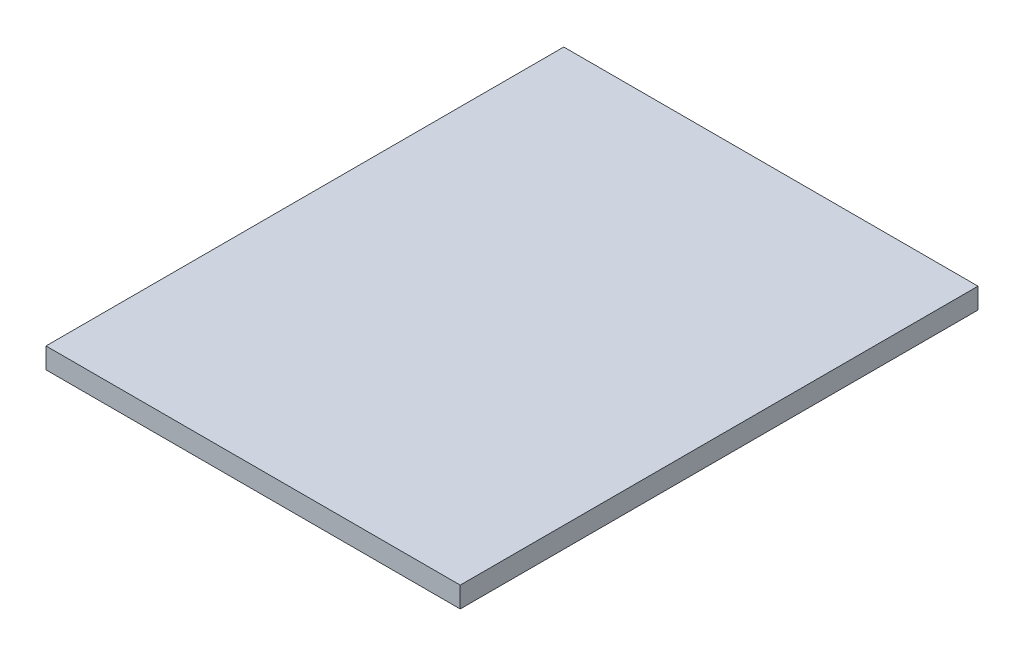
ISO-10303-21;
HEADER;
FILE_DESCRIPTION(('STEP AP214'),'2;1');
FILE_NAME('part.step','',(''),(''),'','','');
FILE_SCHEMA(('AUTOMOTIVE_DESIGN { 1 0 10303 214 1 1 1 1 }'));
ENDSEC;
DATA;
#1=APPLICATION_CONTEXT('core data for automotive mechanical design processes');
#2=APPLICATION_PROTOCOL_DEFINITION('international standard','automotive_design',2000,#1);
#3=PRODUCT_CONTEXT('',#1,'mechanical');
#4=PRODUCT('Part','Part','',(#3));
#5=PRODUCT_RELATED_PRODUCT_CATEGORY('part','',(#4));
#6=PRODUCT_DEFINITION_FORMATION('','',#4);
#7=PRODUCT_DEFINITION_CONTEXT('part definition',#1,'design');
#8=PRODUCT_DEFINITION('design','',#6,#7);
#9=PRODUCT_DEFINITION_SHAPE('','',#8);
#10=(LENGTH_UNIT() NAMED_UNIT(*) SI_UNIT(.MILLI.,.METRE.));
#11=(NAMED_UNIT(*) PLANE_ANGLE_UNIT() SI_UNIT($,.RADIAN.));
#12=(NAMED_UNIT(*) SI_UNIT($,.STERADIAN.) SOLID_ANGLE_UNIT());
#13=UNCERTAINTY_MEASURE_WITH_UNIT(LENGTH_MEASURE(1.E-05),#10,'distance_accuracy_value','');
#14=(GEOMETRIC_REPRESENTATION_CONTEXT(3) GLOBAL_UNCERTAINTY_ASSIGNED_CONTEXT((#13)) GLOBAL_UNIT_ASSIGNED_CONTEXT((#10,
#11,#12)) REPRESENTATION_CONTEXT('',''));
#15=CARTESIAN_POINT('',(0.,0.,0.));
#16=DIRECTION('',(0.,0.,1.));
#17=DIRECTION('',(1.,0.,0.));
#18=AXIS2_PLACEMENT_3D('',#15,#16,#17);
#19=CARTESIAN_POINT('',(0.6484614127169,0.31,0.580957148708004));
#20=DIRECTION('',(0.,0.,-1.));
#21=DIRECTION('',(-1.,0.,0.));
#22=AXIS2_PLACEMENT_3D('',#19,#20,#21);
#23=PLANE('',#22);
#24=DIRECTION('',(1.,0.,0.));
#25=VECTOR('',#24,1.);
#26=CARTESIAN_POINT('',(0.6484614127169,0.3,0.580957148708004));
#27=LINE('',#26,#25);
#28=CARTESIAN_POINT('',(0.4484614127169,0.3,0.580957148708003));
#29=VERTEX_POINT('',#28);
#30=CARTESIAN_POINT('',(0.6484614127169,0.3,0.580957148708004));
#31=VERTEX_POINT('',#30);
#32=EDGE_CURVE('E11',#29,#31,#27,.T.);
#33=ORIENTED_EDGE('',*,*,#32,.T.);
#34=DIRECTION('',(0.,-1.,0.));
#35=VECTOR('',#34,1.);
#36=CARTESIAN_POINT('',(0.6484614127169,0.31,0.580957148708004));
#37=LINE('',#36,#35);
#38=CARTESIAN_POINT('',(0.6484614127169,0.31,0.580957148708004));
#39=VERTEX_POINT('',#38);
#40=EDGE_CURVE('E24',#39,#31,#37,.T.);
#41=ORIENTED_EDGE('',*,*,#40,.F.);
#42=DIRECTION('',(1.,0.,0.));
#43=VECTOR('',#42,1.);
#44=CARTESIAN_POINT('',(0.6484614127169,0.31,0.580957148708004));
#45=LINE('',#44,#43);
#46=CARTESIAN_POINT('',(0.4484614127169,0.31,0.580957148708003));
#47=VERTEX_POINT('',#46);
#48=EDGE_CURVE('E88',#47,#39,#45,.T.);
#49=ORIENTED_EDGE('',*,*,#48,.F.);
#50=DIRECTION('',(0.,-1.,0.));
#51=VECTOR('',#50,1.);
#52=CARTESIAN_POINT('',(0.4484614127169,0.31,0.580957148708003));
#53=LINE('',#52,#51);
#54=EDGE_CURVE('E77',#47,#29,#53,.T.);
#55=ORIENTED_EDGE('',*,*,#54,.T.);
#56=EDGE_LOOP('',(#33,#41,#49,#55));
#57=FACE_BOUND('',#56,.T.);
#58=ADVANCED_FACE('F17',(#57),#23,.F.);
#59=CARTESIAN_POINT('',(0.6484614127169,0.31,0.580957148708004));
#60=DIRECTION('',(-1.,0.,0.));
#61=DIRECTION('',(0.,0.,1.));
#62=AXIS2_PLACEMENT_3D('',#59,#60,#61);
#63=PLANE('',#62);
#64=DIRECTION('',(0.,0.,-1.));
#65=VECTOR('',#64,1.);
#66=CARTESIAN_POINT('',(0.6484614127169,0.3,0.580957148708004));
#67=LINE('',#66,#65);
#68=CARTESIAN_POINT('',(0.6484614127169,0.3,0.330957148708003));
#69=VERTEX_POINT('',#68);
#70=EDGE_CURVE('E85',#31,#69,#67,.T.);
#71=ORIENTED_EDGE('',*,*,#70,.T.);
#72=DIRECTION('',(0.,-1.,0.));
#73=VECTOR('',#72,1.);
#74=CARTESIAN_POINT('',(0.6484614127169,0.31,0.330957148708003));
#75=LINE('',#74,#73);
#76=CARTESIAN_POINT('',(0.6484614127169,0.31,0.330957148708003));
#77=VERTEX_POINT('',#76);
#78=EDGE_CURVE('E83',#77,#69,#75,.T.);
#79=ORIENTED_EDGE('',*,*,#78,.F.);
#80=DIRECTION('',(0.,0.,-1.));
#81=VECTOR('',#80,1.);
#82=CARTESIAN_POINT('',(0.6484614127169,0.31,0.580957148708004));
#83=LINE('',#82,#81);
#84=EDGE_CURVE('E72',#39,#77,#83,.T.);
#85=ORIENTED_EDGE('',*,*,#84,.F.);
#86=ORIENTED_EDGE('',*,*,#40,.T.);
#87=EDGE_LOOP('',(#71,#79,#85,#86));
#88=FACE_BOUND('',#87,.T.);
#89=ADVANCED_FACE('F90',(#88),#63,.F.);
#90=CARTESIAN_POINT('',(0.6484614127169,0.31,0.330957148708003));
#91=DIRECTION('',(0.,0.,1.));
#92=DIRECTION('',(1.,0.,0.));
#93=AXIS2_PLACEMENT_3D('',#90,#91,#92);
#94=PLANE('',#93);
#95=DIRECTION('',(-1.,0.,0.));
#96=VECTOR('',#95,1.);
#97=CARTESIAN_POINT('',(0.6484614127169,0.3,0.330957148708003));
#98=LINE('',#97,#96);
#99=CARTESIAN_POINT('',(0.4484614127169,0.3,0.330957148708003));
#100=VERTEX_POINT('',#99);
#101=EDGE_CURVE('E60',#69,#100,#98,.T.);
#102=ORIENTED_EDGE('',*,*,#101,.T.);
#103=DIRECTION('',(0.,-1.,0.));
#104=VECTOR('',#103,1.);
#105=CARTESIAN_POINT('',(0.4484614127169,0.31,0.330957148708003));
#106=LINE('',#105,#104);
#107=CARTESIAN_POINT('',(0.4484614127169,0.31,0.330957148708003));
#108=VERTEX_POINT('',#107);
#109=EDGE_CURVE('E54',#108,#100,#106,.T.);
#110=ORIENTED_EDGE('',*,*,#109,.F.);
#111=DIRECTION('',(-1.,0.,0.));
#112=VECTOR('',#111,1.);
#113=CARTESIAN_POINT('',(0.6484614127169,0.31,0.330957148708003));
#114=LINE('',#113,#112);
#115=EDGE_CURVE('E58',#77,#108,#114,.T.);
#116=ORIENTED_EDGE('',*,*,#115,.F.);
#117=ORIENTED_EDGE('',*,*,#78,.T.);
#118=EDGE_LOOP('',(#102,#110,#116,#117));
#119=FACE_BOUND('',#118,.T.);
#120=ADVANCED_FACE('F56',(#119),#94,.F.);
#121=CARTESIAN_POINT('',(0.4484614127169,0.31,0.580957148708003));
#122=DIRECTION('',(1.,0.,0.));
#123=DIRECTION('',(0.,0.,-1.));
#124=AXIS2_PLACEMENT_3D('',#121,#122,#123);
#125=PLANE('',#124);
#126=DIRECTION('',(0.,0.,1.));
#127=VECTOR('',#126,1.);
#128=CARTESIAN_POINT('',(0.4484614127169,0.3,0.580957148708003));
#129=LINE('',#128,#127);
#130=EDGE_CURVE('E73',#100,#29,#129,.T.);
#131=ORIENTED_EDGE('',*,*,#130,.T.);
#132=ORIENTED_EDGE('',*,*,#54,.F.);
#133=DIRECTION('',(0.,0.,1.));
#134=VECTOR('',#133,1.);
#135=CARTESIAN_POINT('',(0.4484614127169,0.31,0.580957148708003));
#136=LINE('',#135,#134);
#137=EDGE_CURVE('E70',#108,#47,#136,.T.);
#138=ORIENTED_EDGE('',*,*,#137,.F.);
#139=ORIENTED_EDGE('',*,*,#109,.T.);
#140=EDGE_LOOP('',(#131,#132,#138,#139));
#141=FACE_BOUND('',#140,.T.);
#142=ADVANCED_FACE('F76',(#141),#125,.F.);
#143=CARTESIAN_POINT('',(0.,0.31,0.));
#144=DIRECTION('',(0.,-1.,0.));
#145=DIRECTION('',(0.,0.,-1.));
#146=AXIS2_PLACEMENT_3D('',#143,#144,#145);
#147=PLANE('',#146);
#148=ORIENTED_EDGE('',*,*,#48,.T.);
#149=ORIENTED_EDGE('',*,*,#84,.T.);
#150=ORIENTED_EDGE('',*,*,#115,.T.);
#151=ORIENTED_EDGE('',*,*,#137,.T.);
#152=EDGE_LOOP('',(#148,#149,#150,#151));
#153=FACE_BOUND('',#152,.T.);
#154=ADVANCED_FACE('F69',(#153),#147,.F.);
#155=CARTESIAN_POINT('',(0.,0.3,0.));
#156=DIRECTION('',(0.,-1.,0.));
#157=DIRECTION('',(0.,0.,-1.));
#158=AXIS2_PLACEMENT_3D('',#155,#156,#157);
#159=PLANE('',#158);
#160=ORIENTED_EDGE('',*,*,#32,.F.);
#161=ORIENTED_EDGE('',*,*,#130,.F.);
#162=ORIENTED_EDGE('',*,*,#101,.F.);
#163=ORIENTED_EDGE('',*,*,#70,.F.);
#164=EDGE_LOOP('',(#160,#161,#162,#163));
#165=FACE_BOUND('',#164,.T.);
#166=ADVANCED_FACE('F91',(#165),#159,.T.);
#167=CLOSED_SHELL('',(#58,#89,#120,#142,#154,#166));
#168=MANIFOLD_SOLID_BREP('B1',#167);
#169=ADVANCED_BREP_SHAPE_REPRESENTATION('',(#18,#168),#14);
#170=SHAPE_DEFINITION_REPRESENTATION(#9,#169);
ENDSEC;
END-ISO-10303-21;
